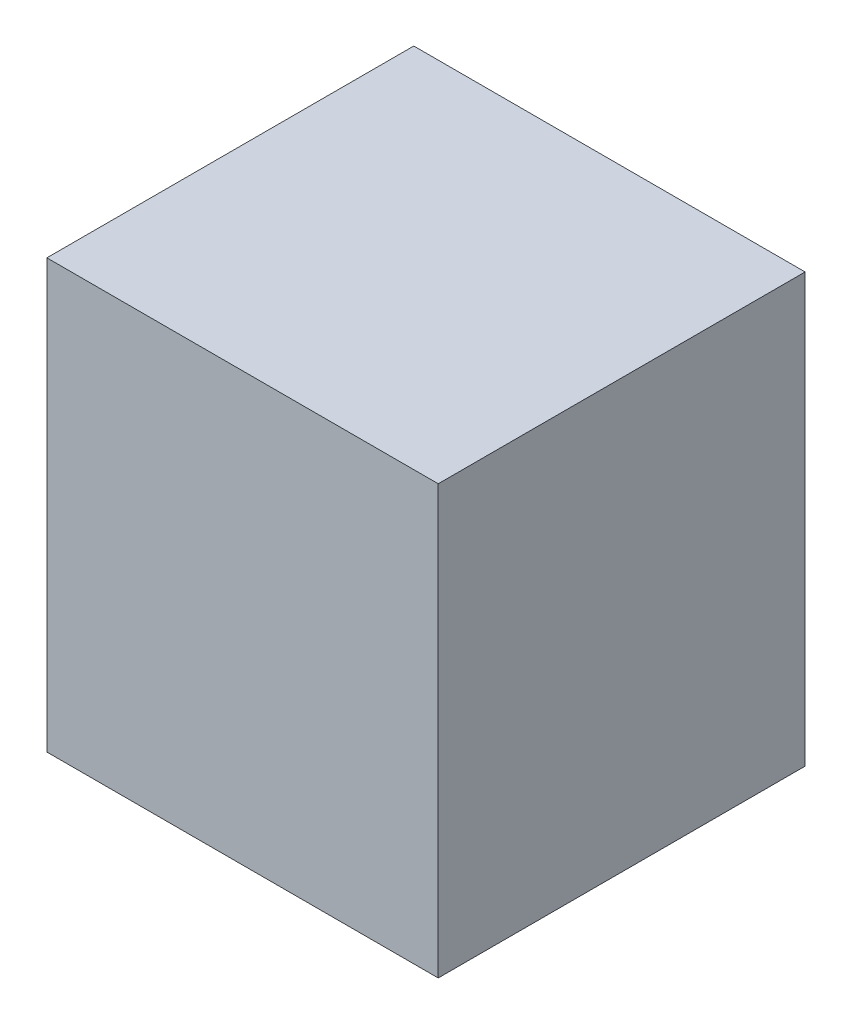
ISO-10303-21;
HEADER;
FILE_DESCRIPTION(('STEP AP214'),'2;1');
FILE_NAME('part.step','',(''),(''),'','','');
FILE_SCHEMA(('AUTOMOTIVE_DESIGN { 1 0 10303 214 1 1 1 1 }'));
ENDSEC;
DATA;
#1=APPLICATION_CONTEXT('core data for automotive mechanical design processes');
#2=APPLICATION_PROTOCOL_DEFINITION('international standard','automotive_design',2000,#1);
#3=PRODUCT_CONTEXT('',#1,'mechanical');
#4=PRODUCT('Part','Part','',(#3));
#5=PRODUCT_RELATED_PRODUCT_CATEGORY('part','',(#4));
#6=PRODUCT_DEFINITION_FORMATION('','',#4);
#7=PRODUCT_DEFINITION_CONTEXT('part definition',#1,'design');
#8=PRODUCT_DEFINITION('design','',#6,#7);
#9=PRODUCT_DEFINITION_SHAPE('','',#8);
#10=(LENGTH_UNIT() NAMED_UNIT(*) SI_UNIT(.MILLI.,.METRE.));
#11=(NAMED_UNIT(*) PLANE_ANGLE_UNIT() SI_UNIT($,.RADIAN.));
#12=(NAMED_UNIT(*) SI_UNIT($,.STERADIAN.) SOLID_ANGLE_UNIT());
#13=UNCERTAINTY_MEASURE_WITH_UNIT(LENGTH_MEASURE(1.E-05),#10,'distance_accuracy_value','');
#14=(GEOMETRIC_REPRESENTATION_CONTEXT(3) GLOBAL_UNCERTAINTY_ASSIGNED_CONTEXT((#13)) GLOBAL_UNIT_ASSIGNED_CONTEXT((#10,
#11,#12)) REPRESENTATION_CONTEXT('',''));
#15=CARTESIAN_POINT('',(0.,0.,0.));
#16=DIRECTION('',(0.,0.,1.));
#17=DIRECTION('',(1.,0.,0.));
#18=AXIS2_PLACEMENT_3D('',#15,#16,#17);
#19=CARTESIAN_POINT('',(0.48000158,0.52500022,0.90000074));
#20=DIRECTION('',(0.,0.,-1.));
#21=DIRECTION('',(-1.,0.,0.));
#22=AXIS2_PLACEMENT_3D('',#19,#20,#21);
#23=PLANE('',#22);
#24=DIRECTION('',(0.,1.,0.));
#25=VECTOR('',#24,1.);
#26=CARTESIAN_POINT('',(-0.47999904,0.52500022,0.90000074));
#27=LINE('',#26,#25);
#28=CARTESIAN_POINT('',(-0.47999904,0.52500022,0.90000074));
#29=VERTEX_POINT('',#28);
#30=CARTESIAN_POINT('',(-0.47999904,-0.52499768,0.90000074));
#31=VERTEX_POINT('',#30);
#32=EDGE_CURVE('E54',#29,#31,#27,.F.);
#33=ORIENTED_EDGE('',*,*,#32,.T.);
#34=DIRECTION('',(1.,0.,0.));
#35=VECTOR('',#34,1.);
#36=CARTESIAN_POINT('',(-0.47999904,-0.52499768,0.90000074));
#37=LINE('',#36,#35);
#38=CARTESIAN_POINT('',(0.48000158,-0.52499768,0.90000074));
#39=VERTEX_POINT('',#38);
#40=EDGE_CURVE('E56',#31,#39,#37,.T.);
#41=ORIENTED_EDGE('',*,*,#40,.T.);
#42=DIRECTION('',(0.,1.,0.));
#43=VECTOR('',#42,1.);
#44=CARTESIAN_POINT('',(0.48000158,-0.52499768,0.90000074));
#45=LINE('',#44,#43);
#46=CARTESIAN_POINT('',(0.48000158,0.52500022,0.90000074));
#47=VERTEX_POINT('',#46);
#48=EDGE_CURVE('E19',#39,#47,#45,.T.);
#49=ORIENTED_EDGE('',*,*,#48,.T.);
#50=DIRECTION('',(1.,0.,0.));
#51=VECTOR('',#50,1.);
#52=CARTESIAN_POINT('',(0.48000158,0.52500022,0.90000074));
#53=LINE('',#52,#51);
#54=EDGE_CURVE('E79',#47,#29,#53,.F.);
#55=ORIENTED_EDGE('',*,*,#54,.T.);
#56=EDGE_LOOP('',(#33,#41,#49,#55));
#57=FACE_BOUND('',#56,.T.);
#58=ADVANCED_FACE('F16',(#57),#23,.F.);
#59=CARTESIAN_POINT('',(0.48000158,-0.52499768,0.));
#60=DIRECTION('',(-1.,0.,0.));
#61=DIRECTION('',(0.,0.,1.));
#62=AXIS2_PLACEMENT_3D('',#59,#60,#61);
#63=PLANE('',#62);
#64=DIRECTION('',(0.,0.,-1.));
#65=VECTOR('',#64,1.);
#66=CARTESIAN_POINT('',(0.48000158,0.52500022,0.));
#67=LINE('',#66,#65);
#68=CARTESIAN_POINT('',(0.48000158,0.52500022,0.));
#69=VERTEX_POINT('',#68);
#70=EDGE_CURVE('E67',#69,#47,#67,.F.);
#71=ORIENTED_EDGE('',*,*,#70,.T.);
#72=ORIENTED_EDGE('',*,*,#48,.F.);
#73=DIRECTION('',(0.,0.,1.));
#74=VECTOR('',#73,1.);
#75=CARTESIAN_POINT('',(0.48000158,-0.52499768,0.));
#76=LINE('',#75,#74);
#77=CARTESIAN_POINT('',(0.48000158,-0.52499768,0.));
#78=VERTEX_POINT('',#77);
#79=EDGE_CURVE('E62',#39,#78,#76,.F.);
#80=ORIENTED_EDGE('',*,*,#79,.T.);
#81=DIRECTION('',(0.,1.,0.));
#82=VECTOR('',#81,1.);
#83=CARTESIAN_POINT('',(0.48000158,0.52500022,0.));
#84=LINE('',#83,#82);
#85=EDGE_CURVE('E82',#69,#78,#84,.F.);
#86=ORIENTED_EDGE('',*,*,#85,.F.);
#87=EDGE_LOOP('',(#71,#72,#80,#86));
#88=FACE_BOUND('',#87,.T.);
#89=ADVANCED_FACE('F64',(#88),#63,.F.);
#90=CARTESIAN_POINT('',(-0.47999904,-0.52499768,0.));
#91=DIRECTION('',(0.,1.,0.));
#92=DIRECTION('',(0.,0.,1.));
#93=AXIS2_PLACEMENT_3D('',#90,#91,#92);
#94=PLANE('',#93);
#95=ORIENTED_EDGE('',*,*,#79,.F.);
#96=ORIENTED_EDGE('',*,*,#40,.F.);
#97=DIRECTION('',(0.,0.,-1.));
#98=VECTOR('',#97,1.);
#99=CARTESIAN_POINT('',(-0.47999904,-0.52499768,0.));
#100=LINE('',#99,#98);
#101=CARTESIAN_POINT('',(-0.47999904,-0.52499768,0.));
#102=VERTEX_POINT('',#101);
#103=EDGE_CURVE('E74',#31,#102,#100,.T.);
#104=ORIENTED_EDGE('',*,*,#103,.T.);
#105=DIRECTION('',(-1.,0.,0.));
#106=VECTOR('',#105,1.);
#107=CARTESIAN_POINT('',(0.48000158,-0.52499768,0.));
#108=LINE('',#107,#106);
#109=EDGE_CURVE('E71',#78,#102,#108,.T.);
#110=ORIENTED_EDGE('',*,*,#109,.F.);
#111=EDGE_LOOP('',(#95,#96,#104,#110));
#112=FACE_BOUND('',#111,.T.);
#113=ADVANCED_FACE('F69',(#112),#94,.F.);
#114=CARTESIAN_POINT('',(-0.47999904,0.52500022,0.));
#115=DIRECTION('',(1.,0.,0.));
#116=DIRECTION('',(0.,0.,-1.));
#117=AXIS2_PLACEMENT_3D('',#114,#115,#116);
#118=PLANE('',#117);
#119=ORIENTED_EDGE('',*,*,#103,.F.);
#120=ORIENTED_EDGE('',*,*,#32,.F.);
#121=DIRECTION('',(0.,0.,-1.));
#122=VECTOR('',#121,1.);
#123=CARTESIAN_POINT('',(-0.47999904,0.52500022,0.));
#124=LINE('',#123,#122);
#125=CARTESIAN_POINT('',(-0.47999904,0.52500022,0.));
#126=VERTEX_POINT('',#125);
#127=EDGE_CURVE('E34',#29,#126,#124,.T.);
#128=ORIENTED_EDGE('',*,*,#127,.T.);
#129=DIRECTION('',(0.,1.,0.));
#130=VECTOR('',#129,1.);
#131=CARTESIAN_POINT('',(-0.47999904,0.52500022,0.));
#132=LINE('',#131,#130);
#133=EDGE_CURVE('E25',#102,#126,#132,.T.);
#134=ORIENTED_EDGE('',*,*,#133,.F.);
#135=EDGE_LOOP('',(#119,#120,#128,#134));
#136=FACE_BOUND('',#135,.T.);
#137=ADVANCED_FACE('F88',(#136),#118,.F.);
#138=CARTESIAN_POINT('',(0.48000158,0.52500022,0.));
#139=DIRECTION('',(0.,-1.,0.));
#140=DIRECTION('',(0.,0.,-1.));
#141=AXIS2_PLACEMENT_3D('',#138,#139,#140);
#142=PLANE('',#141);
#143=ORIENTED_EDGE('',*,*,#127,.F.);
#144=ORIENTED_EDGE('',*,*,#54,.F.);
#145=ORIENTED_EDGE('',*,*,#70,.F.);
#146=DIRECTION('',(-1.,0.,0.));
#147=VECTOR('',#146,1.);
#148=CARTESIAN_POINT('',(0.48000158,0.52500022,0.));
#149=LINE('',#148,#147);
#150=EDGE_CURVE('E11',#126,#69,#149,.F.);
#151=ORIENTED_EDGE('',*,*,#150,.F.);
#152=EDGE_LOOP('',(#143,#144,#145,#151));
#153=FACE_BOUND('',#152,.T.);
#154=ADVANCED_FACE('F90',(#153),#142,.F.);
#155=CARTESIAN_POINT('',(0.48000158,0.52500022,0.));
#156=DIRECTION('',(0.,0.,-1.));
#157=DIRECTION('',(-1.,0.,0.));
#158=AXIS2_PLACEMENT_3D('',#155,#156,#157);
#159=PLANE('',#158);
#160=ORIENTED_EDGE('',*,*,#133,.T.);
#161=ORIENTED_EDGE('',*,*,#150,.T.);
#162=ORIENTED_EDGE('',*,*,#85,.T.);
#163=ORIENTED_EDGE('',*,*,#109,.T.);
#164=EDGE_LOOP('',(#160,#161,#162,#163));
#165=FACE_BOUND('',#164,.T.);
#166=ADVANCED_FACE('F87',(#165),#159,.T.);
#167=CLOSED_SHELL('',(#58,#89,#113,#137,#154,#166));
#168=MANIFOLD_SOLID_BREP('B1',#167);
#169=ADVANCED_BREP_SHAPE_REPRESENTATION('',(#18,#168),#14);
#170=SHAPE_DEFINITION_REPRESENTATION(#9,#169);
ENDSEC;
END-ISO-10303-21;
